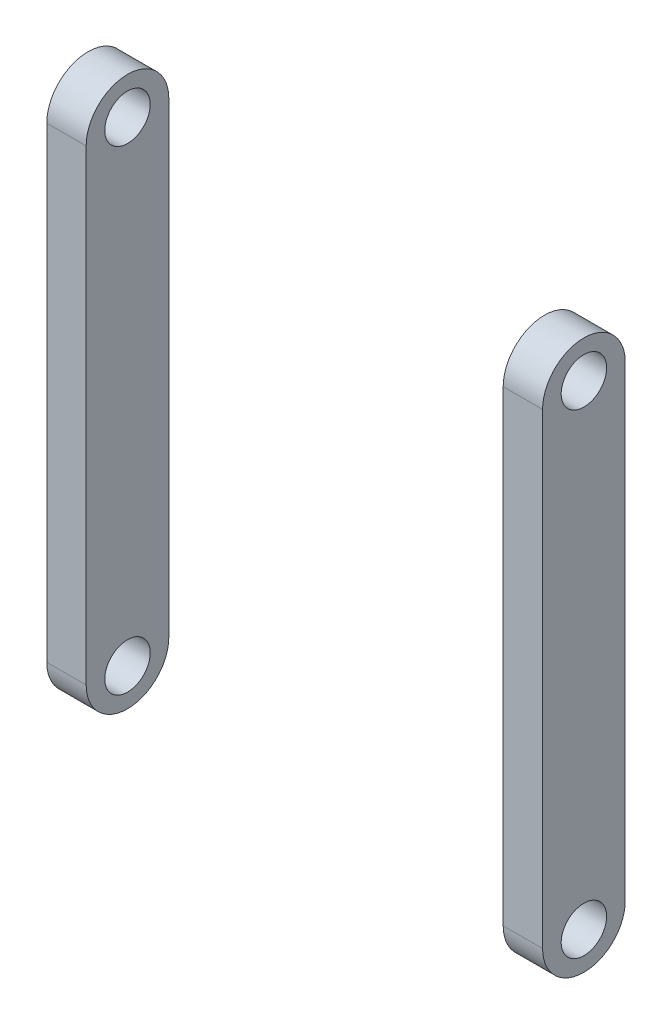
ISO-10303-21;
HEADER;
FILE_DESCRIPTION(('STEP AP214'),'2;1');
FILE_NAME('part.step','',(''),(''),'','','');
FILE_SCHEMA(('AUTOMOTIVE_DESIGN { 1 0 10303 214 1 1 1 1 }'));
ENDSEC;
DATA;
#1=APPLICATION_CONTEXT('core data for automotive mechanical design processes');
#2=APPLICATION_PROTOCOL_DEFINITION('international standard','automotive_design',2000,#1);
#3=PRODUCT_CONTEXT('',#1,'mechanical');
#4=PRODUCT('Part','Part','',(#3));
#5=PRODUCT_RELATED_PRODUCT_CATEGORY('part','',(#4));
#6=PRODUCT_DEFINITION_FORMATION('','',#4);
#7=PRODUCT_DEFINITION_CONTEXT('part definition',#1,'design');
#8=PRODUCT_DEFINITION('design','',#6,#7);
#9=PRODUCT_DEFINITION_SHAPE('','',#8);
#10=(LENGTH_UNIT() NAMED_UNIT(*) SI_UNIT(.MILLI.,.METRE.));
#11=(NAMED_UNIT(*) PLANE_ANGLE_UNIT() SI_UNIT($,.RADIAN.));
#12=(NAMED_UNIT(*) SI_UNIT($,.STERADIAN.) SOLID_ANGLE_UNIT());
#13=UNCERTAINTY_MEASURE_WITH_UNIT(LENGTH_MEASURE(1.E-05),#10,'distance_accuracy_value','');
#14=(GEOMETRIC_REPRESENTATION_CONTEXT(3) GLOBAL_UNCERTAINTY_ASSIGNED_CONTEXT((#13)) GLOBAL_UNIT_ASSIGNED_CONTEXT((#10,
#11,#12)) REPRESENTATION_CONTEXT('',''));
#15=CARTESIAN_POINT('',(0.,0.,0.));
#16=DIRECTION('',(0.,0.,1.));
#17=DIRECTION('',(1.,0.,0.));
#18=AXIS2_PLACEMENT_3D('',#15,#16,#17);
#19=CARTESIAN_POINT('',(-36.4999999999752,0.,-4.));
#20=DIRECTION('',(-1.,0.,0.));
#21=DIRECTION('',(0.,0.,1.));
#22=AXIS2_PLACEMENT_3D('',#19,#20,#21);
#23=PLANE('',#22);
#24=CARTESIAN_POINT('',(-36.4999999999752,-4.99999999999997,-2.00000000000015));
#25=DIRECTION('',(1.,0.,0.));
#26=DIRECTION('',(0.,1.,0.));
#27=AXIS2_PLACEMENT_3D('',#24,#25,#26);
#28=CIRCLE('',#27,1.1);
#29=CARTESIAN_POINT('',(-36.4999999999752,-3.89999999999997,-2.00000000000015));
#30=VERTEX_POINT('',#29);
#31=EDGE_CURVE('E132',#30,#30,#28,.T.);
#32=ORIENTED_EDGE('',*,*,#31,.T.);
#33=EDGE_LOOP('',(#32));
#34=FACE_BOUND('',#33,.T.);
#35=CARTESIAN_POINT('',(-36.4999999999752,-28.0000000000001,-2.));
#36=DIRECTION('',(1.,0.,0.));
#37=DIRECTION('',(0.,1.,0.));
#38=AXIS2_PLACEMENT_3D('',#35,#36,#37);
#39=CIRCLE('',#38,1.1);
#40=CARTESIAN_POINT('',(-36.4999999999752,-26.9000000000001,-2.));
#41=VERTEX_POINT('',#40);
#42=EDGE_CURVE('E155',#41,#41,#39,.T.);
#43=ORIENTED_EDGE('',*,*,#42,.T.);
#44=EDGE_LOOP('',(#43));
#45=FACE_BOUND('',#44,.T.);
#46=DIRECTION('',(0.,-1.,0.));
#47=VECTOR('',#46,1.);
#48=CARTESIAN_POINT('',(-36.4999999999752,0.,0.));
#49=LINE('',#48,#47);
#50=CARTESIAN_POINT('',(-36.4999999999752,-5.19999999999997,0.));
#51=VERTEX_POINT('',#50);
#52=CARTESIAN_POINT('',(-36.4999999999752,-27.8000000000001,0.));
#53=VERTEX_POINT('',#52);
#54=EDGE_CURVE('E131',#51,#53,#49,.T.);
#55=ORIENTED_EDGE('',*,*,#54,.F.);
#56=CARTESIAN_POINT('',(-36.4999999999752,-5.19999999999997,-2.));
#57=DIRECTION('',(1.,0.,0.));
#58=DIRECTION('',(0.,1.,0.));
#59=AXIS2_PLACEMENT_3D('',#56,#57,#58);
#60=CIRCLE('',#59,2.);
#61=CARTESIAN_POINT('',(-36.4999999999752,-5.19999999999997,-4.));
#62=VERTEX_POINT('',#61);
#63=EDGE_CURVE('E101',#62,#51,#60,.T.);
#64=ORIENTED_EDGE('',*,*,#63,.F.);
#65=DIRECTION('',(0.,-1.,0.));
#66=VECTOR('',#65,1.);
#67=CARTESIAN_POINT('',(-36.4999999999752,0.,-4.));
#68=LINE('',#67,#66);
#69=CARTESIAN_POINT('',(-36.4999999999752,-27.8000000000001,-4.));
#70=VERTEX_POINT('',#69);
#71=EDGE_CURVE('E85',#62,#70,#68,.T.);
#72=ORIENTED_EDGE('',*,*,#71,.T.);
#73=CARTESIAN_POINT('',(-36.4999999999752,-27.8000000000001,-2.));
#74=DIRECTION('',(1.,0.,0.));
#75=DIRECTION('',(0.,1.,0.));
#76=AXIS2_PLACEMENT_3D('',#73,#74,#75);
#77=CIRCLE('',#76,2.);
#78=EDGE_CURVE('E153',#53,#70,#77,.T.);
#79=ORIENTED_EDGE('',*,*,#78,.F.);
#80=EDGE_LOOP('',(#55,#64,#72,#79));
#81=FACE_BOUND('',#80,.T.);
#82=ADVANCED_FACE('F77',(#34,#45,#81),#23,.T.);
#83=CARTESIAN_POINT('',(-34.5933796280838,0.,-4.));
#84=DIRECTION('',(-1.,0.,0.));
#85=DIRECTION('',(0.,-1.,0.));
#86=AXIS2_PLACEMENT_3D('',#83,#84,#85);
#87=PLANE('',#86);
#88=CARTESIAN_POINT('',(-34.5933796280838,-28.0000000000001,-2.));
#89=DIRECTION('',(-1.,0.,0.));
#90=DIRECTION('',(0.,-1.,0.));
#91=AXIS2_PLACEMENT_3D('',#88,#89,#90);
#92=CIRCLE('',#91,1.1);
#93=CARTESIAN_POINT('',(-34.5933796280838,-29.1000000000001,-2.));
#94=VERTEX_POINT('',#93);
#95=EDGE_CURVE('E144',#94,#94,#92,.T.);
#96=ORIENTED_EDGE('',*,*,#95,.T.);
#97=EDGE_LOOP('',(#96));
#98=FACE_BOUND('',#97,.T.);
#99=CARTESIAN_POINT('',(-34.5933796280838,-4.99999999999997,-2.00000000000015));
#100=DIRECTION('',(-1.,0.,0.));
#101=DIRECTION('',(0.,-1.,0.));
#102=AXIS2_PLACEMENT_3D('',#99,#100,#101);
#103=CIRCLE('',#102,1.1);
#104=CARTESIAN_POINT('',(-34.5933796280838,-6.09999999999997,-2.00000000000015));
#105=VERTEX_POINT('',#104);
#106=EDGE_CURVE('E80',#105,#105,#103,.T.);
#107=ORIENTED_EDGE('',*,*,#106,.T.);
#108=EDGE_LOOP('',(#107));
#109=FACE_BOUND('',#108,.T.);
#110=CARTESIAN_POINT('',(-34.5933796280838,-5.19999999999997,-2.));
#111=DIRECTION('',(-1.,0.,0.));
#112=DIRECTION('',(0.,-1.,0.));
#113=AXIS2_PLACEMENT_3D('',#110,#111,#112);
#114=CIRCLE('',#113,2.);
#115=CARTESIAN_POINT('',(-34.5933796280838,-5.19999999999997,0.));
#116=VERTEX_POINT('',#115);
#117=CARTESIAN_POINT('',(-34.5933796280838,-5.19999999999997,-4.));
#118=VERTEX_POINT('',#117);
#119=EDGE_CURVE('E120',#116,#118,#114,.T.);
#120=ORIENTED_EDGE('',*,*,#119,.F.);
#121=DIRECTION('',(0.,-1.,0.));
#122=VECTOR('',#121,1.);
#123=CARTESIAN_POINT('',(-34.5933796280838,0.,0.));
#124=LINE('',#123,#122);
#125=CARTESIAN_POINT('',(-34.5933796280838,-27.8000000000001,0.));
#126=VERTEX_POINT('',#125);
#127=EDGE_CURVE('E137',#116,#126,#124,.T.);
#128=ORIENTED_EDGE('',*,*,#127,.T.);
#129=CARTESIAN_POINT('',(-34.5933796280838,-27.8000000000001,-2.));
#130=DIRECTION('',(-1.,0.,0.));
#131=DIRECTION('',(0.,-1.,0.));
#132=AXIS2_PLACEMENT_3D('',#129,#130,#131);
#133=CIRCLE('',#132,2.);
#134=CARTESIAN_POINT('',(-34.5933796280838,-27.8000000000001,-4.));
#135=VERTEX_POINT('',#134);
#136=EDGE_CURVE('E93',#135,#126,#133,.T.);
#137=ORIENTED_EDGE('',*,*,#136,.F.);
#138=DIRECTION('',(0.,-1.,0.));
#139=VECTOR('',#138,1.);
#140=CARTESIAN_POINT('',(-34.5933796280838,0.,-4.));
#141=LINE('',#140,#139);
#142=EDGE_CURVE('E13',#118,#135,#141,.T.);
#143=ORIENTED_EDGE('',*,*,#142,.F.);
#144=EDGE_LOOP('',(#120,#128,#137,#143));
#145=FACE_BOUND('',#144,.T.);
#146=ADVANCED_FACE('F171',(#98,#109,#145),#87,.F.);
#147=CARTESIAN_POINT('',(0.,0.,-4.));
#148=DIRECTION('',(0.,0.,1.));
#149=DIRECTION('',(1.,0.,0.));
#150=AXIS2_PLACEMENT_3D('',#147,#148,#149);
#151=PLANE('',#150);
#152=ORIENTED_EDGE('',*,*,#71,.F.);
#153=DIRECTION('',(1.,0.,0.));
#154=VECTOR('',#153,1.);
#155=CARTESIAN_POINT('',(-36.4999999999752,-5.19999999999997,-4.));
#156=LINE('',#155,#154);
#157=EDGE_CURVE('E117',#62,#118,#156,.T.);
#158=ORIENTED_EDGE('',*,*,#157,.T.);
#159=ORIENTED_EDGE('',*,*,#142,.T.);
#160=DIRECTION('',(1.,0.,0.));
#161=VECTOR('',#160,1.);
#162=CARTESIAN_POINT('',(-36.4999999999752,-27.8000000000001,-4.));
#163=LINE('',#162,#161);
#164=EDGE_CURVE('E136',#70,#135,#163,.T.);
#165=ORIENTED_EDGE('',*,*,#164,.F.);
#166=EDGE_LOOP('',(#152,#158,#159,#165));
#167=FACE_BOUND('',#166,.T.);
#168=ADVANCED_FACE('F135',(#167),#151,.F.);
#169=CARTESIAN_POINT('',(0.,0.,0.));
#170=DIRECTION('',(0.,0.,1.));
#171=DIRECTION('',(1.,0.,0.));
#172=AXIS2_PLACEMENT_3D('',#169,#170,#171);
#173=PLANE('',#172);
#174=DIRECTION('',(1.,0.,0.));
#175=VECTOR('',#174,1.);
#176=CARTESIAN_POINT('',(-36.4999999999752,-5.19999999999997,0.));
#177=LINE('',#176,#175);
#178=EDGE_CURVE('E124',#51,#116,#177,.T.);
#179=ORIENTED_EDGE('',*,*,#178,.F.);
#180=ORIENTED_EDGE('',*,*,#54,.T.);
#181=DIRECTION('',(1.,0.,0.));
#182=VECTOR('',#181,1.);
#183=CARTESIAN_POINT('',(-36.4999999999752,-27.8000000000001,0.));
#184=LINE('',#183,#182);
#185=EDGE_CURVE('E151',#53,#126,#184,.T.);
#186=ORIENTED_EDGE('',*,*,#185,.T.);
#187=ORIENTED_EDGE('',*,*,#127,.F.);
#188=EDGE_LOOP('',(#179,#180,#186,#187));
#189=FACE_BOUND('',#188,.T.);
#190=ADVANCED_FACE('F176',(#189),#173,.T.);
#191=CARTESIAN_POINT('',(-36.4999999999752,-27.8000000000001,-2.));
#192=DIRECTION('',(1.,0.,0.));
#193=DIRECTION('',(0.,1.,0.));
#194=AXIS2_PLACEMENT_3D('',#191,#192,#193);
#195=CYLINDRICAL_SURFACE('',#194,2.);
#196=ORIENTED_EDGE('',*,*,#136,.T.);
#197=ORIENTED_EDGE('',*,*,#185,.F.);
#198=ORIENTED_EDGE('',*,*,#78,.T.);
#199=ORIENTED_EDGE('',*,*,#164,.T.);
#200=EDGE_LOOP('',(#196,#197,#198,#199));
#201=FACE_BOUND('',#200,.T.);
#202=ADVANCED_FACE('F177',(#201),#195,.T.);
#203=CARTESIAN_POINT('',(-36.4999999999752,-5.19999999999997,-2.));
#204=DIRECTION('',(1.,0.,0.));
#205=DIRECTION('',(0.,1.,0.));
#206=AXIS2_PLACEMENT_3D('',#203,#204,#205);
#207=CYLINDRICAL_SURFACE('',#206,2.);
#208=ORIENTED_EDGE('',*,*,#119,.T.);
#209=ORIENTED_EDGE('',*,*,#157,.F.);
#210=ORIENTED_EDGE('',*,*,#63,.T.);
#211=ORIENTED_EDGE('',*,*,#178,.T.);
#212=EDGE_LOOP('',(#208,#209,#210,#211));
#213=FACE_BOUND('',#212,.T.);
#214=ADVANCED_FACE('F118',(#213),#207,.T.);
#215=CARTESIAN_POINT('',(-36.4999999999752,-28.0000000000001,-2.));
#216=DIRECTION('',(1.,0.,0.));
#217=DIRECTION('',(0.,1.,0.));
#218=AXIS2_PLACEMENT_3D('',#215,#216,#217);
#219=CYLINDRICAL_SURFACE('',#218,1.1);
#220=ORIENTED_EDGE('',*,*,#42,.F.);
#221=EDGE_LOOP('',(#220));
#222=FACE_BOUND('',#221,.T.);
#223=ORIENTED_EDGE('',*,*,#95,.F.);
#224=EDGE_LOOP('',(#223));
#225=FACE_BOUND('',#224,.T.);
#226=ADVANCED_FACE('F167',(#222,#225),#219,.F.);
#227=CARTESIAN_POINT('',(-36.4999999999752,-4.99999999999997,-2.00000000000015));
#228=DIRECTION('',(1.,0.,0.));
#229=DIRECTION('',(0.,1.,0.));
#230=AXIS2_PLACEMENT_3D('',#227,#228,#229);
#231=CYLINDRICAL_SURFACE('',#230,1.1);
#232=ORIENTED_EDGE('',*,*,#31,.F.);
#233=EDGE_LOOP('',(#232));
#234=FACE_BOUND('',#233,.T.);
#235=ORIENTED_EDGE('',*,*,#106,.F.);
#236=EDGE_LOOP('',(#235));
#237=FACE_BOUND('',#236,.T.);
#238=ADVANCED_FACE('F164',(#234,#237),#231,.F.);
#239=CLOSED_SHELL('',(#82,#146,#168,#190,#202,#214,#226,#238));
#240=MANIFOLD_SOLID_BREP('B2',#239);
#241=CARTESIAN_POINT('',(-12.4999999999751,0.,-4.));
#242=DIRECTION('',(-1.,0.,0.));
#243=DIRECTION('',(0.,-1.,0.));
#244=AXIS2_PLACEMENT_3D('',#241,#242,#243);
#245=PLANE('',#244);
#246=CARTESIAN_POINT('',(-12.4999999999751,-28.0000000000001,-2.));
#247=DIRECTION('',(1.,0.,0.));
#248=DIRECTION('',(0.,1.,0.));
#249=AXIS2_PLACEMENT_3D('',#246,#247,#248);
#250=CIRCLE('',#249,1.1);
#251=CARTESIAN_POINT('',(-12.4999999999751,-26.9000000000001,-2.));
#252=VERTEX_POINT('',#251);
#253=EDGE_CURVE('E324',#252,#252,#250,.T.);
#254=ORIENTED_EDGE('',*,*,#253,.F.);
#255=EDGE_LOOP('',(#254));
#256=FACE_BOUND('',#255,.T.);
#257=CARTESIAN_POINT('',(-12.4999999999751,-4.99999999999996,-2.00000000000015));
#258=DIRECTION('',(1.,0.,0.));
#259=DIRECTION('',(0.,1.,0.));
#260=AXIS2_PLACEMENT_3D('',#257,#258,#259);
#261=CIRCLE('',#260,1.1);
#262=CARTESIAN_POINT('',(-12.4999999999751,-3.89999999999996,-2.00000000000015));
#263=VERTEX_POINT('',#262);
#264=EDGE_CURVE('E291',#263,#263,#261,.T.);
#265=ORIENTED_EDGE('',*,*,#264,.F.);
#266=EDGE_LOOP('',(#265));
#267=FACE_BOUND('',#266,.T.);
#268=CARTESIAN_POINT('',(-12.4999999999751,-5.19999999999996,-2.));
#269=DIRECTION('',(1.,0.,0.));
#270=DIRECTION('',(0.,1.,0.));
#271=AXIS2_PLACEMENT_3D('',#268,#269,#270);
#272=CIRCLE('',#271,2.);
#273=CARTESIAN_POINT('',(-12.4999999999751,-5.19999999999996,-4.));
#274=VERTEX_POINT('',#273);
#275=CARTESIAN_POINT('',(-12.4999999999751,-5.19999999999996,0.));
#276=VERTEX_POINT('',#275);
#277=EDGE_CURVE('E283',#274,#276,#272,.T.);
#278=ORIENTED_EDGE('',*,*,#277,.T.);
#279=DIRECTION('',(0.,-1.,0.));
#280=VECTOR('',#279,1.);
#281=CARTESIAN_POINT('',(-12.4999999999751,0.,0.));
#282=LINE('',#281,#280);
#283=CARTESIAN_POINT('',(-12.4999999999751,-27.8000000000001,0.));
#284=VERTEX_POINT('',#283);
#285=EDGE_CURVE('E305',#276,#284,#282,.T.);
#286=ORIENTED_EDGE('',*,*,#285,.T.);
#287=CARTESIAN_POINT('',(-12.4999999999751,-27.8000000000001,-2.));
#288=DIRECTION('',(1.,0.,0.));
#289=DIRECTION('',(0.,1.,0.));
#290=AXIS2_PLACEMENT_3D('',#287,#288,#289);
#291=CIRCLE('',#290,2.);
#292=CARTESIAN_POINT('',(-12.4999999999751,-27.8000000000001,-4.));
#293=VERTEX_POINT('',#292);
#294=EDGE_CURVE('E260',#284,#293,#291,.T.);
#295=ORIENTED_EDGE('',*,*,#294,.T.);
#296=DIRECTION('',(0.,-1.,0.));
#297=VECTOR('',#296,1.);
#298=CARTESIAN_POINT('',(-12.4999999999751,0.,-4.));
#299=LINE('',#298,#297);
#300=EDGE_CURVE('E298',#274,#293,#299,.T.);
#301=ORIENTED_EDGE('',*,*,#300,.F.);
#302=EDGE_LOOP('',(#278,#286,#295,#301));
#303=FACE_BOUND('',#302,.T.);
#304=ADVANCED_FACE('F243',(#256,#267,#303),#245,.F.);
#305=CARTESIAN_POINT('',(-14.4066203718665,0.,-4.));
#306=DIRECTION('',(-1.,0.,0.));
#307=DIRECTION('',(0.,-1.,0.));
#308=AXIS2_PLACEMENT_3D('',#305,#306,#307);
#309=PLANE('',#308);
#310=CARTESIAN_POINT('',(-14.4066203718665,-4.99999999999997,-2.00000000000015));
#311=DIRECTION('',(-1.,0.,0.));
#312=DIRECTION('',(0.,-1.,0.));
#313=AXIS2_PLACEMENT_3D('',#310,#311,#312);
#314=CIRCLE('',#313,1.1);
#315=CARTESIAN_POINT('',(-14.4066203718665,-6.09999999999997,-2.00000000000015));
#316=VERTEX_POINT('',#315);
#317=EDGE_CURVE('E247',#316,#316,#314,.T.);
#318=ORIENTED_EDGE('',*,*,#317,.F.);
#319=EDGE_LOOP('',(#318));
#320=FACE_BOUND('',#319,.T.);
#321=CARTESIAN_POINT('',(-14.4066203718665,-28.0000000000001,-2.));
#322=DIRECTION('',(-1.,0.,0.));
#323=DIRECTION('',(0.,-1.,0.));
#324=AXIS2_PLACEMENT_3D('',#321,#322,#323);
#325=CIRCLE('',#324,1.1);
#326=CARTESIAN_POINT('',(-14.4066203718665,-29.1000000000001,-2.));
#327=VERTEX_POINT('',#326);
#328=EDGE_CURVE('E312',#327,#327,#325,.T.);
#329=ORIENTED_EDGE('',*,*,#328,.F.);
#330=EDGE_LOOP('',(#329));
#331=FACE_BOUND('',#330,.T.);
#332=DIRECTION('',(0.,-1.,0.));
#333=VECTOR('',#332,1.);
#334=CARTESIAN_POINT('',(-14.4066203718665,0.,0.));
#335=LINE('',#334,#333);
#336=CARTESIAN_POINT('',(-14.4066203718665,-5.19999999999996,0.));
#337=VERTEX_POINT('',#336);
#338=CARTESIAN_POINT('',(-14.4066203718665,-27.8000000000001,0.));
#339=VERTEX_POINT('',#338);
#340=EDGE_CURVE('E309',#337,#339,#335,.T.);
#341=ORIENTED_EDGE('',*,*,#340,.F.);
#342=CARTESIAN_POINT('',(-14.4066203718665,-5.19999999999996,-2.));
#343=DIRECTION('',(-1.,0.,0.));
#344=DIRECTION('',(0.,-1.,0.));
#345=AXIS2_PLACEMENT_3D('',#342,#343,#344);
#346=CIRCLE('',#345,2.);
#347=CARTESIAN_POINT('',(-14.4066203718665,-5.19999999999996,-4.));
#348=VERTEX_POINT('',#347);
#349=EDGE_CURVE('E267',#337,#348,#346,.T.);
#350=ORIENTED_EDGE('',*,*,#349,.T.);
#351=DIRECTION('',(0.,-1.,0.));
#352=VECTOR('',#351,1.);
#353=CARTESIAN_POINT('',(-14.4066203718665,0.,-4.));
#354=LINE('',#353,#352);
#355=CARTESIAN_POINT('',(-14.4066203718665,-27.8000000000001,-4.));
#356=VERTEX_POINT('',#355);
#357=EDGE_CURVE('E300',#348,#356,#354,.T.);
#358=ORIENTED_EDGE('',*,*,#357,.T.);
#359=CARTESIAN_POINT('',(-14.4066203718665,-27.8000000000001,-2.));
#360=DIRECTION('',(-1.,0.,0.));
#361=DIRECTION('',(0.,-1.,0.));
#362=AXIS2_PLACEMENT_3D('',#359,#360,#361);
#363=CIRCLE('',#362,2.);
#364=EDGE_CURVE('E301',#356,#339,#363,.T.);
#365=ORIENTED_EDGE('',*,*,#364,.T.);
#366=EDGE_LOOP('',(#341,#350,#358,#365));
#367=FACE_BOUND('',#366,.T.);
#368=ADVANCED_FACE('F245',(#320,#331,#367),#309,.T.);
#369=CARTESIAN_POINT('',(0.,0.,-4.));
#370=DIRECTION('',(0.,0.,1.));
#371=DIRECTION('',(1.,0.,0.));
#372=AXIS2_PLACEMENT_3D('',#369,#370,#371);
#373=PLANE('',#372);
#374=ORIENTED_EDGE('',*,*,#357,.F.);
#375=DIRECTION('',(1.,0.,0.));
#376=VECTOR('',#375,1.);
#377=CARTESIAN_POINT('',(-36.4999999999752,-5.19999999999997,-4.));
#378=LINE('',#377,#376);
#379=EDGE_CURVE('E286',#348,#274,#378,.T.);
#380=ORIENTED_EDGE('',*,*,#379,.T.);
#381=ORIENTED_EDGE('',*,*,#300,.T.);
#382=DIRECTION('',(1.,0.,0.));
#383=VECTOR('',#382,1.);
#384=CARTESIAN_POINT('',(-36.4999999999752,-27.8000000000001,-4.));
#385=LINE('',#384,#383);
#386=EDGE_CURVE('E322',#356,#293,#385,.T.);
#387=ORIENTED_EDGE('',*,*,#386,.F.);
#388=EDGE_LOOP('',(#374,#380,#381,#387));
#389=FACE_BOUND('',#388,.T.);
#390=ADVANCED_FACE('F296',(#389),#373,.F.);
#391=CARTESIAN_POINT('',(0.,0.,0.));
#392=DIRECTION('',(0.,0.,1.));
#393=DIRECTION('',(1.,0.,0.));
#394=AXIS2_PLACEMENT_3D('',#391,#392,#393);
#395=PLANE('',#394);
#396=DIRECTION('',(1.,0.,0.));
#397=VECTOR('',#396,1.);
#398=CARTESIAN_POINT('',(-36.4999999999752,-5.19999999999997,0.));
#399=LINE('',#398,#397);
#400=EDGE_CURVE('E75',#337,#276,#399,.T.);
#401=ORIENTED_EDGE('',*,*,#400,.F.);
#402=ORIENTED_EDGE('',*,*,#340,.T.);
#403=DIRECTION('',(1.,0.,0.));
#404=VECTOR('',#403,1.);
#405=CARTESIAN_POINT('',(-36.4999999999752,-27.8000000000001,0.));
#406=LINE('',#405,#404);
#407=EDGE_CURVE('E252',#339,#284,#406,.T.);
#408=ORIENTED_EDGE('',*,*,#407,.T.);
#409=ORIENTED_EDGE('',*,*,#285,.F.);
#410=EDGE_LOOP('',(#401,#402,#408,#409));
#411=FACE_BOUND('',#410,.T.);
#412=ADVANCED_FACE('F341',(#411),#395,.T.);
#413=CARTESIAN_POINT('',(-36.4999999999752,-27.8000000000001,-2.));
#414=DIRECTION('',(1.,0.,0.));
#415=DIRECTION('',(0.,1.,0.));
#416=AXIS2_PLACEMENT_3D('',#413,#414,#415);
#417=CYLINDRICAL_SURFACE('',#416,2.);
#418=ORIENTED_EDGE('',*,*,#386,.T.);
#419=ORIENTED_EDGE('',*,*,#294,.F.);
#420=ORIENTED_EDGE('',*,*,#407,.F.);
#421=ORIENTED_EDGE('',*,*,#364,.F.);
#422=EDGE_LOOP('',(#418,#419,#420,#421));
#423=FACE_BOUND('',#422,.T.);
#424=ADVANCED_FACE('F344',(#423),#417,.T.);
#425=CARTESIAN_POINT('',(-36.4999999999752,-5.19999999999997,-2.));
#426=DIRECTION('',(1.,0.,0.));
#427=DIRECTION('',(0.,1.,0.));
#428=AXIS2_PLACEMENT_3D('',#425,#426,#427);
#429=CYLINDRICAL_SURFACE('',#428,2.);
#430=ORIENTED_EDGE('',*,*,#400,.T.);
#431=ORIENTED_EDGE('',*,*,#277,.F.);
#432=ORIENTED_EDGE('',*,*,#379,.F.);
#433=ORIENTED_EDGE('',*,*,#349,.F.);
#434=EDGE_LOOP('',(#430,#431,#432,#433));
#435=FACE_BOUND('',#434,.T.);
#436=ADVANCED_FACE('F285',(#435),#429,.T.);
#437=CARTESIAN_POINT('',(-36.4999999999752,-28.0000000000001,-2.));
#438=DIRECTION('',(1.,0.,0.));
#439=DIRECTION('',(0.,1.,0.));
#440=AXIS2_PLACEMENT_3D('',#437,#438,#439);
#441=CYLINDRICAL_SURFACE('',#440,1.1);
#442=ORIENTED_EDGE('',*,*,#328,.T.);
#443=EDGE_LOOP('',(#442));
#444=FACE_BOUND('',#443,.T.);
#445=ORIENTED_EDGE('',*,*,#253,.T.);
#446=EDGE_LOOP('',(#445));
#447=FACE_BOUND('',#446,.T.);
#448=ADVANCED_FACE('F350',(#444,#447),#441,.F.);
#449=CARTESIAN_POINT('',(-36.4999999999752,-4.99999999999997,-2.00000000000015));
#450=DIRECTION('',(1.,0.,0.));
#451=DIRECTION('',(0.,1.,0.));
#452=AXIS2_PLACEMENT_3D('',#449,#450,#451);
#453=CYLINDRICAL_SURFACE('',#452,1.1);
#454=ORIENTED_EDGE('',*,*,#317,.T.);
#455=EDGE_LOOP('',(#454));
#456=FACE_BOUND('',#455,.T.);
#457=ORIENTED_EDGE('',*,*,#264,.T.);
#458=EDGE_LOOP('',(#457));
#459=FACE_BOUND('',#458,.T.);
#460=ADVANCED_FACE('F331',(#456,#459),#453,.F.);
#461=CLOSED_SHELL('',(#304,#368,#390,#412,#424,#436,#448,#460));
#462=MANIFOLD_SOLID_BREP('B7',#461);
#463=ADVANCED_BREP_SHAPE_REPRESENTATION('',(#18,#240,#462),#14);
#464=SHAPE_DEFINITION_REPRESENTATION(#9,#463);
ENDSEC;
END-ISO-10303-21;
